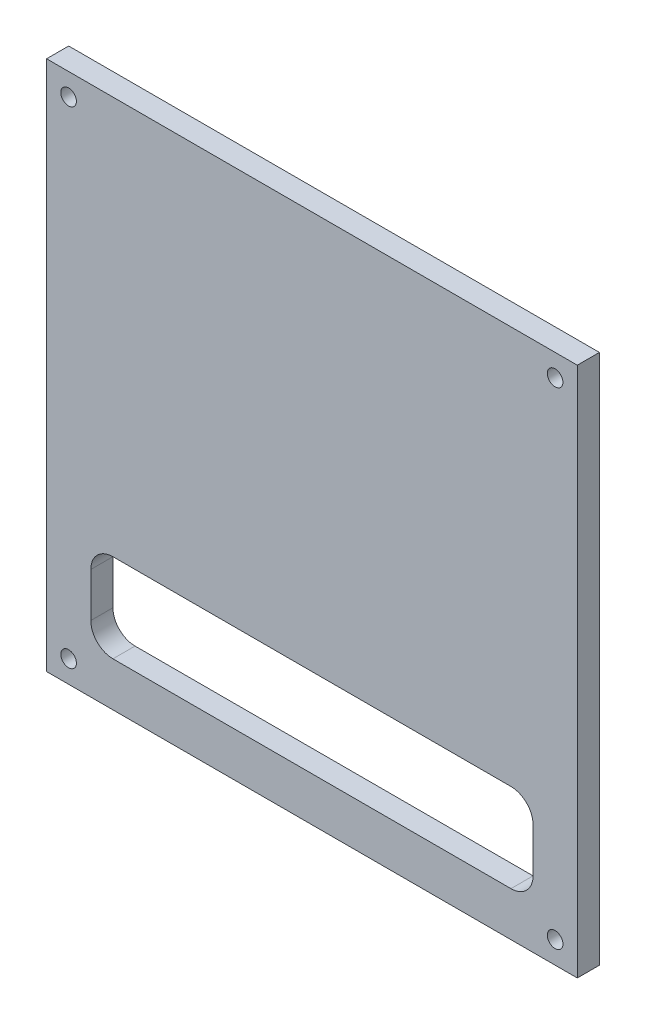
ISO-10303-21;
HEADER;
FILE_DESCRIPTION(('STEP AP214'),'2;1');
FILE_NAME('part.step','',(''),(''),'','','');
FILE_SCHEMA(('AUTOMOTIVE_DESIGN { 1 0 10303 214 1 1 1 1 }'));
ENDSEC;
DATA;
#1=APPLICATION_CONTEXT('core data for automotive mechanical design processes');
#2=APPLICATION_PROTOCOL_DEFINITION('international standard','automotive_design',2000,#1);
#3=PRODUCT_CONTEXT('',#1,'mechanical');
#4=PRODUCT('Part','Part','',(#3));
#5=PRODUCT_RELATED_PRODUCT_CATEGORY('part','',(#4));
#6=PRODUCT_DEFINITION_FORMATION('','',#4);
#7=PRODUCT_DEFINITION_CONTEXT('part definition',#1,'design');
#8=PRODUCT_DEFINITION('design','',#6,#7);
#9=PRODUCT_DEFINITION_SHAPE('','',#8);
#10=(LENGTH_UNIT() NAMED_UNIT(*) SI_UNIT(.MILLI.,.METRE.));
#11=(NAMED_UNIT(*) PLANE_ANGLE_UNIT() SI_UNIT($,.RADIAN.));
#12=(NAMED_UNIT(*) SI_UNIT($,.STERADIAN.) SOLID_ANGLE_UNIT());
#13=UNCERTAINTY_MEASURE_WITH_UNIT(LENGTH_MEASURE(1.E-05),#10,'distance_accuracy_value','');
#14=(GEOMETRIC_REPRESENTATION_CONTEXT(3) GLOBAL_UNCERTAINTY_ASSIGNED_CONTEXT((#13)) GLOBAL_UNIT_ASSIGNED_CONTEXT((#10,
#11,#12)) REPRESENTATION_CONTEXT('',''));
#15=CARTESIAN_POINT('',(0.,0.,0.));
#16=DIRECTION('',(0.,0.,1.));
#17=DIRECTION('',(1.,0.,0.));
#18=AXIS2_PLACEMENT_3D('',#15,#16,#17);
#19=CARTESIAN_POINT('',(-163.974683544304,2.38908752134528E-13,6.35));
#20=DIRECTION('',(1.,0.,0.));
#21=DIRECTION('',(0.,1.,0.));
#22=AXIS2_PLACEMENT_3D('',#19,#20,#21);
#23=PLANE('',#22);
#24=DIRECTION('',(0.,-1.,0.));
#25=VECTOR('',#24,1.);
#26=CARTESIAN_POINT('',(-163.974683544304,2.38908752134528E-13,0.));
#27=LINE('',#26,#25);
#28=CARTESIAN_POINT('',(-163.974683544304,235.851475625838,0.));
#29=VERTEX_POINT('',#28);
#30=CARTESIAN_POINT('',(-163.974683544304,83.4514756258377,0.));
#31=VERTEX_POINT('',#30);
#32=EDGE_CURVE('E181',#29,#31,#27,.T.);
#33=ORIENTED_EDGE('',*,*,#32,.F.);
#34=DIRECTION('',(0.,0.,-1.));
#35=VECTOR('',#34,1.);
#36=CARTESIAN_POINT('',(-163.974683544304,235.851475625838,6.35));
#37=LINE('',#36,#35);
#38=CARTESIAN_POINT('',(-163.974683544304,235.851475625838,6.35));
#39=VERTEX_POINT('',#38);
#40=EDGE_CURVE('E11',#39,#29,#37,.T.);
#41=ORIENTED_EDGE('',*,*,#40,.F.);
#42=DIRECTION('',(0.,-1.,0.));
#43=VECTOR('',#42,1.);
#44=CARTESIAN_POINT('',(-163.974683544304,2.38908752134528E-13,6.35));
#45=LINE('',#44,#43);
#46=CARTESIAN_POINT('',(-163.974683544304,83.4514756258377,6.35));
#47=VERTEX_POINT('',#46);
#48=EDGE_CURVE('E151',#39,#47,#45,.T.);
#49=ORIENTED_EDGE('',*,*,#48,.T.);
#50=DIRECTION('',(0.,0.,-1.));
#51=VECTOR('',#50,1.);
#52=CARTESIAN_POINT('',(-163.974683544304,83.4514756258377,6.35));
#53=LINE('',#52,#51);
#54=EDGE_CURVE('E101',#47,#31,#53,.T.);
#55=ORIENTED_EDGE('',*,*,#54,.T.);
#56=EDGE_LOOP('',(#33,#41,#49,#55));
#57=FACE_BOUND('',#56,.T.);
#58=ADVANCED_FACE('F35',(#57),#23,.T.);
#59=CARTESIAN_POINT('',(0.,235.851475625838,6.35));
#60=DIRECTION('',(0.,1.,0.));
#61=DIRECTION('',(0.,0.,1.));
#62=AXIS2_PLACEMENT_3D('',#59,#60,#61);
#63=PLANE('',#62);
#64=DIRECTION('',(1.,0.,0.));
#65=VECTOR('',#64,1.);
#66=CARTESIAN_POINT('',(0.,235.851475625838,0.));
#67=LINE('',#66,#65);
#68=CARTESIAN_POINT('',(-316.374683544304,235.851475625838,0.));
#69=VERTEX_POINT('',#68);
#70=EDGE_CURVE('E141',#69,#29,#67,.T.);
#71=ORIENTED_EDGE('',*,*,#70,.F.);
#72=DIRECTION('',(0.,0.,-1.));
#73=VECTOR('',#72,1.);
#74=CARTESIAN_POINT('',(-316.374683544304,235.851475625838,6.35));
#75=LINE('',#74,#73);
#76=CARTESIAN_POINT('',(-316.374683544304,235.851475625838,6.35));
#77=VERTEX_POINT('',#76);
#78=EDGE_CURVE('E45',#77,#69,#75,.T.);
#79=ORIENTED_EDGE('',*,*,#78,.F.);
#80=DIRECTION('',(1.,0.,0.));
#81=VECTOR('',#80,1.);
#82=CARTESIAN_POINT('',(0.,235.851475625838,6.35));
#83=LINE('',#82,#81);
#84=EDGE_CURVE('E139',#77,#39,#83,.T.);
#85=ORIENTED_EDGE('',*,*,#84,.T.);
#86=ORIENTED_EDGE('',*,*,#40,.T.);
#87=EDGE_LOOP('',(#71,#79,#85,#86));
#88=FACE_BOUND('',#87,.T.);
#89=ADVANCED_FACE('F137',(#88),#63,.T.);
#90=CARTESIAN_POINT('',(-316.374683544304,0.,6.35));
#91=DIRECTION('',(1.,0.,0.));
#92=DIRECTION('',(0.,0.,-1.));
#93=AXIS2_PLACEMENT_3D('',#90,#91,#92);
#94=PLANE('',#93);
#95=DIRECTION('',(0.,-1.,0.));
#96=VECTOR('',#95,1.);
#97=CARTESIAN_POINT('',(-316.374683544304,0.,0.));
#98=LINE('',#97,#96);
#99=CARTESIAN_POINT('',(-316.374683544304,83.4514756258377,0.));
#100=VERTEX_POINT('',#99);
#101=EDGE_CURVE('E184',#69,#100,#98,.T.);
#102=ORIENTED_EDGE('',*,*,#101,.T.);
#103=DIRECTION('',(0.,0.,-1.));
#104=VECTOR('',#103,1.);
#105=CARTESIAN_POINT('',(-316.374683544304,83.4514756258377,6.35));
#106=LINE('',#105,#104);
#107=CARTESIAN_POINT('',(-316.374683544304,83.4514756258377,6.35));
#108=VERTEX_POINT('',#107);
#109=EDGE_CURVE('E144',#108,#100,#106,.T.);
#110=ORIENTED_EDGE('',*,*,#109,.F.);
#111=DIRECTION('',(0.,-1.,0.));
#112=VECTOR('',#111,1.);
#113=CARTESIAN_POINT('',(-316.374683544304,0.,6.35));
#114=LINE('',#113,#112);
#115=EDGE_CURVE('E147',#77,#108,#114,.T.);
#116=ORIENTED_EDGE('',*,*,#115,.F.);
#117=ORIENTED_EDGE('',*,*,#78,.T.);
#118=EDGE_LOOP('',(#102,#110,#116,#117));
#119=FACE_BOUND('',#118,.T.);
#120=ADVANCED_FACE('F148',(#119),#94,.F.);
#121=CARTESIAN_POINT('',(-176.674683544304,0.,6.35));
#122=DIRECTION('',(-1.,0.,0.));
#123=DIRECTION('',(0.,0.,1.));
#124=AXIS2_PLACEMENT_3D('',#121,#122,#123);
#125=PLANE('',#124);
#126=DIRECTION('',(0.,1.,0.));
#127=VECTOR('',#126,1.);
#128=CARTESIAN_POINT('',(-176.674683544304,0.,0.));
#129=LINE('',#128,#127);
#130=CARTESIAN_POINT('',(-176.674683544304,102.501475625838,0.));
#131=VERTEX_POINT('',#130);
#132=CARTESIAN_POINT('',(-176.674683544304,115.201475625838,0.));
#133=VERTEX_POINT('',#132);
#134=EDGE_CURVE('E159',#131,#133,#129,.T.);
#135=ORIENTED_EDGE('',*,*,#134,.F.);
#136=DIRECTION('',(0.,0.,-1.));
#137=VECTOR('',#136,1.);
#138=CARTESIAN_POINT('',(-176.674683544304,102.501475625838,6.35));
#139=LINE('',#138,#137);
#140=CARTESIAN_POINT('',(-176.674683544304,102.501475625838,6.35));
#141=VERTEX_POINT('',#140);
#142=EDGE_CURVE('E39',#141,#131,#139,.T.);
#143=ORIENTED_EDGE('',*,*,#142,.F.);
#144=DIRECTION('',(0.,1.,0.));
#145=VECTOR('',#144,1.);
#146=CARTESIAN_POINT('',(-176.674683544304,0.,6.35));
#147=LINE('',#146,#145);
#148=CARTESIAN_POINT('',(-176.674683544304,115.201475625838,6.35));
#149=VERTEX_POINT('',#148);
#150=EDGE_CURVE('E187',#141,#149,#147,.T.);
#151=ORIENTED_EDGE('',*,*,#150,.T.);
#152=DIRECTION('',(0.,0.,-1.));
#153=VECTOR('',#152,1.);
#154=CARTESIAN_POINT('',(-176.674683544304,115.201475625838,6.35));
#155=LINE('',#154,#153);
#156=EDGE_CURVE('E158',#149,#133,#155,.T.);
#157=ORIENTED_EDGE('',*,*,#156,.T.);
#158=EDGE_LOOP('',(#135,#143,#151,#157));
#159=FACE_BOUND('',#158,.T.);
#160=ADVANCED_FACE('F37',(#159),#125,.T.);
#161=CARTESIAN_POINT('',(-183.024683544304,102.501475625838,6.35));
#162=DIRECTION('',(0.,0.,-1.));
#163=DIRECTION('',(-1.,0.,0.));
#164=AXIS2_PLACEMENT_3D('',#161,#162,#163);
#165=CYLINDRICAL_SURFACE('',#164,6.34999999999998);
#166=CARTESIAN_POINT('',(-183.024683544304,102.501475625838,0.));
#167=DIRECTION('',(0.,0.,1.));
#168=DIRECTION('',(1.,0.,0.));
#169=AXIS2_PLACEMENT_3D('',#166,#167,#168);
#170=CIRCLE('',#169,6.34999999999998);
#171=CARTESIAN_POINT('',(-183.024683544304,96.1514756258377,0.));
#172=VERTEX_POINT('',#171);
#173=EDGE_CURVE('E162',#172,#131,#170,.T.);
#174=ORIENTED_EDGE('',*,*,#173,.F.);
#175=DIRECTION('',(0.,0.,-1.));
#176=VECTOR('',#175,1.);
#177=CARTESIAN_POINT('',(-183.024683544304,96.1514756258377,6.35));
#178=LINE('',#177,#176);
#179=CARTESIAN_POINT('',(-183.024683544304,96.1514756258377,6.35));
#180=VERTEX_POINT('',#179);
#181=EDGE_CURVE('E203',#180,#172,#178,.T.);
#182=ORIENTED_EDGE('',*,*,#181,.F.);
#183=CARTESIAN_POINT('',(-183.024683544304,102.501475625838,6.35));
#184=DIRECTION('',(0.,0.,1.));
#185=DIRECTION('',(1.,0.,0.));
#186=AXIS2_PLACEMENT_3D('',#183,#184,#185);
#187=CIRCLE('',#186,6.34999999999998);
#188=EDGE_CURVE('E212',#180,#141,#187,.T.);
#189=ORIENTED_EDGE('',*,*,#188,.T.);
#190=ORIENTED_EDGE('',*,*,#142,.T.);
#191=EDGE_LOOP('',(#174,#182,#189,#190));
#192=FACE_BOUND('',#191,.T.);
#193=ADVANCED_FACE('F210',(#192),#165,.F.);
#194=CARTESIAN_POINT('',(0.,96.1514756258376,6.35));
#195=DIRECTION('',(0.,1.,0.));
#196=DIRECTION('',(-1.,0.,0.));
#197=AXIS2_PLACEMENT_3D('',#194,#195,#196);
#198=PLANE('',#197);
#199=DIRECTION('',(1.,0.,0.));
#200=VECTOR('',#199,1.);
#201=CARTESIAN_POINT('',(0.,96.1514756258376,0.));
#202=LINE('',#201,#200);
#203=CARTESIAN_POINT('',(-297.324683544304,96.1514756258377,0.));
#204=VERTEX_POINT('',#203);
#205=EDGE_CURVE('E166',#204,#172,#202,.T.);
#206=ORIENTED_EDGE('',*,*,#205,.F.);
#207=DIRECTION('',(0.,0.,-1.));
#208=VECTOR('',#207,1.);
#209=CARTESIAN_POINT('',(-297.324683544304,96.1514756258377,6.35));
#210=LINE('',#209,#208);
#211=CARTESIAN_POINT('',(-297.324683544304,96.1514756258377,6.35));
#212=VERTEX_POINT('',#211);
#213=EDGE_CURVE('E202',#212,#204,#210,.T.);
#214=ORIENTED_EDGE('',*,*,#213,.F.);
#215=DIRECTION('',(1.,0.,0.));
#216=VECTOR('',#215,1.);
#217=CARTESIAN_POINT('',(0.,96.1514756258376,6.35));
#218=LINE('',#217,#216);
#219=EDGE_CURVE('E221',#212,#180,#218,.T.);
#220=ORIENTED_EDGE('',*,*,#219,.T.);
#221=ORIENTED_EDGE('',*,*,#181,.T.);
#222=EDGE_LOOP('',(#206,#214,#220,#221));
#223=FACE_BOUND('',#222,.T.);
#224=ADVANCED_FACE('F219',(#223),#198,.T.);
#225=CARTESIAN_POINT('',(-297.324683544304,102.501475625838,6.35));
#226=DIRECTION('',(0.,0.,-1.));
#227=DIRECTION('',(-1.,0.,0.));
#228=AXIS2_PLACEMENT_3D('',#225,#226,#227);
#229=CYLINDRICAL_SURFACE('',#228,6.34999999999998);
#230=CARTESIAN_POINT('',(-297.324683544304,102.501475625838,0.));
#231=DIRECTION('',(0.,0.,1.));
#232=DIRECTION('',(1.,0.,0.));
#233=AXIS2_PLACEMENT_3D('',#230,#231,#232);
#234=CIRCLE('',#233,6.34999999999998);
#235=CARTESIAN_POINT('',(-303.674683544304,102.501475625838,0.));
#236=VERTEX_POINT('',#235);
#237=EDGE_CURVE('E169',#236,#204,#234,.T.);
#238=ORIENTED_EDGE('',*,*,#237,.F.);
#239=DIRECTION('',(0.,0.,-1.));
#240=VECTOR('',#239,1.);
#241=CARTESIAN_POINT('',(-303.674683544304,102.501475625838,6.35));
#242=LINE('',#241,#240);
#243=CARTESIAN_POINT('',(-303.674683544304,102.501475625838,6.35));
#244=VERTEX_POINT('',#243);
#245=EDGE_CURVE('E200',#244,#236,#242,.T.);
#246=ORIENTED_EDGE('',*,*,#245,.F.);
#247=CARTESIAN_POINT('',(-297.324683544304,102.501475625838,6.35));
#248=DIRECTION('',(0.,0.,1.));
#249=DIRECTION('',(1.,0.,0.));
#250=AXIS2_PLACEMENT_3D('',#247,#248,#249);
#251=CIRCLE('',#250,6.34999999999998);
#252=EDGE_CURVE('E226',#244,#212,#251,.T.);
#253=ORIENTED_EDGE('',*,*,#252,.T.);
#254=ORIENTED_EDGE('',*,*,#213,.T.);
#255=EDGE_LOOP('',(#238,#246,#253,#254));
#256=FACE_BOUND('',#255,.T.);
#257=ADVANCED_FACE('F228',(#256),#229,.F.);
#258=CARTESIAN_POINT('',(-303.674683544304,0.,6.35));
#259=DIRECTION('',(-1.,0.,0.));
#260=DIRECTION('',(0.,0.,1.));
#261=AXIS2_PLACEMENT_3D('',#258,#259,#260);
#262=PLANE('',#261);
#263=DIRECTION('',(0.,1.,0.));
#264=VECTOR('',#263,1.);
#265=CARTESIAN_POINT('',(-303.674683544304,0.,0.));
#266=LINE('',#265,#264);
#267=CARTESIAN_POINT('',(-303.674683544304,115.201475625838,0.));
#268=VERTEX_POINT('',#267);
#269=EDGE_CURVE('E172',#236,#268,#266,.T.);
#270=ORIENTED_EDGE('',*,*,#269,.T.);
#271=DIRECTION('',(0.,0.,-1.));
#272=VECTOR('',#271,1.);
#273=CARTESIAN_POINT('',(-303.674683544304,115.201475625838,6.35));
#274=LINE('',#273,#272);
#275=CARTESIAN_POINT('',(-303.674683544304,115.201475625838,6.35));
#276=VERTEX_POINT('',#275);
#277=EDGE_CURVE('E197',#276,#268,#274,.T.);
#278=ORIENTED_EDGE('',*,*,#277,.F.);
#279=DIRECTION('',(0.,1.,0.));
#280=VECTOR('',#279,1.);
#281=CARTESIAN_POINT('',(-303.674683544304,0.,6.35));
#282=LINE('',#281,#280);
#283=EDGE_CURVE('E230',#244,#276,#282,.T.);
#284=ORIENTED_EDGE('',*,*,#283,.F.);
#285=ORIENTED_EDGE('',*,*,#245,.T.);
#286=EDGE_LOOP('',(#270,#278,#284,#285));
#287=FACE_BOUND('',#286,.T.);
#288=ADVANCED_FACE('F313',(#287),#262,.F.);
#289=CARTESIAN_POINT('',(-297.324683544304,115.201475625838,6.35));
#290=DIRECTION('',(0.,0.,-1.));
#291=DIRECTION('',(-1.,0.,0.));
#292=AXIS2_PLACEMENT_3D('',#289,#290,#291);
#293=CYLINDRICAL_SURFACE('',#292,6.34999999999997);
#294=CARTESIAN_POINT('',(-297.324683544304,115.201475625838,0.));
#295=DIRECTION('',(0.,0.,1.));
#296=DIRECTION('',(1.,0.,0.));
#297=AXIS2_PLACEMENT_3D('',#294,#295,#296);
#298=CIRCLE('',#297,6.34999999999997);
#299=CARTESIAN_POINT('',(-297.324683544304,121.551475625838,0.));
#300=VERTEX_POINT('',#299);
#301=EDGE_CURVE('E174',#268,#300,#298,.F.);
#302=ORIENTED_EDGE('',*,*,#301,.T.);
#303=DIRECTION('',(0.,0.,-1.));
#304=VECTOR('',#303,1.);
#305=CARTESIAN_POINT('',(-297.324683544304,121.551475625838,6.35));
#306=LINE('',#305,#304);
#307=CARTESIAN_POINT('',(-297.324683544304,121.551475625838,6.35));
#308=VERTEX_POINT('',#307);
#309=EDGE_CURVE('E194',#308,#300,#306,.T.);
#310=ORIENTED_EDGE('',*,*,#309,.F.);
#311=CARTESIAN_POINT('',(-297.324683544304,115.201475625838,6.35));
#312=DIRECTION('',(0.,0.,1.));
#313=DIRECTION('',(1.,0.,0.));
#314=AXIS2_PLACEMENT_3D('',#311,#312,#313);
#315=CIRCLE('',#314,6.34999999999997);
#316=EDGE_CURVE('E232',#276,#308,#315,.F.);
#317=ORIENTED_EDGE('',*,*,#316,.F.);
#318=ORIENTED_EDGE('',*,*,#277,.T.);
#319=EDGE_LOOP('',(#302,#310,#317,#318));
#320=FACE_BOUND('',#319,.T.);
#321=ADVANCED_FACE('F309',(#320),#293,.F.);
#322=CARTESIAN_POINT('',(0.,121.551475625838,6.35));
#323=DIRECTION('',(0.,1.,0.));
#324=DIRECTION('',(0.,0.,1.));
#325=AXIS2_PLACEMENT_3D('',#322,#323,#324);
#326=PLANE('',#325);
#327=DIRECTION('',(1.,0.,0.));
#328=VECTOR('',#327,1.);
#329=CARTESIAN_POINT('',(0.,121.551475625838,0.));
#330=LINE('',#329,#328);
#331=CARTESIAN_POINT('',(-183.024683544304,121.551475625838,0.));
#332=VERTEX_POINT('',#331);
#333=EDGE_CURVE('E176',#300,#332,#330,.T.);
#334=ORIENTED_EDGE('',*,*,#333,.T.);
#335=DIRECTION('',(0.,0.,-1.));
#336=VECTOR('',#335,1.);
#337=CARTESIAN_POINT('',(-183.024683544304,121.551475625838,6.35));
#338=LINE('',#337,#336);
#339=CARTESIAN_POINT('',(-183.024683544304,121.551475625838,6.35));
#340=VERTEX_POINT('',#339);
#341=EDGE_CURVE('E191',#340,#332,#338,.T.);
#342=ORIENTED_EDGE('',*,*,#341,.F.);
#343=DIRECTION('',(1.,0.,0.));
#344=VECTOR('',#343,1.);
#345=CARTESIAN_POINT('',(0.,121.551475625838,6.35));
#346=LINE('',#345,#344);
#347=EDGE_CURVE('E237',#308,#340,#346,.T.);
#348=ORIENTED_EDGE('',*,*,#347,.F.);
#349=ORIENTED_EDGE('',*,*,#309,.T.);
#350=EDGE_LOOP('',(#334,#342,#348,#349));
#351=FACE_BOUND('',#350,.T.);
#352=ADVANCED_FACE('F306',(#351),#326,.F.);
#353=CARTESIAN_POINT('',(-183.024683544304,115.201475625838,6.35));
#354=DIRECTION('',(0.,0.,-1.));
#355=DIRECTION('',(-1.,0.,0.));
#356=AXIS2_PLACEMENT_3D('',#353,#354,#355);
#357=CYLINDRICAL_SURFACE('',#356,6.34999999999997);
#358=CARTESIAN_POINT('',(-183.024683544304,115.201475625838,0.));
#359=DIRECTION('',(0.,0.,1.));
#360=DIRECTION('',(1.,0.,0.));
#361=AXIS2_PLACEMENT_3D('',#358,#359,#360);
#362=CIRCLE('',#361,6.34999999999997);
#363=EDGE_CURVE('E178',#332,#133,#362,.F.);
#364=ORIENTED_EDGE('',*,*,#363,.T.);
#365=ORIENTED_EDGE('',*,*,#156,.F.);
#366=CARTESIAN_POINT('',(-183.024683544304,115.201475625838,6.35));
#367=DIRECTION('',(0.,0.,1.));
#368=DIRECTION('',(1.,0.,0.));
#369=AXIS2_PLACEMENT_3D('',#366,#367,#368);
#370=CIRCLE('',#369,6.34999999999997);
#371=EDGE_CURVE('E153',#340,#149,#370,.F.);
#372=ORIENTED_EDGE('',*,*,#371,.F.);
#373=ORIENTED_EDGE('',*,*,#341,.T.);
#374=EDGE_LOOP('',(#364,#365,#372,#373));
#375=FACE_BOUND('',#374,.T.);
#376=ADVANCED_FACE('F242',(#375),#357,.F.);
#377=CARTESIAN_POINT('',(0.,83.4514756258377,6.35));
#378=DIRECTION('',(0.,1.,0.));
#379=DIRECTION('',(0.,0.,1.));
#380=AXIS2_PLACEMENT_3D('',#377,#378,#379);
#381=PLANE('',#380);
#382=DIRECTION('',(1.,0.,0.));
#383=VECTOR('',#382,1.);
#384=CARTESIAN_POINT('',(0.,83.4514756258377,0.));
#385=LINE('',#384,#383);
#386=EDGE_CURVE('E94',#100,#31,#385,.T.);
#387=ORIENTED_EDGE('',*,*,#386,.T.);
#388=ORIENTED_EDGE('',*,*,#54,.F.);
#389=DIRECTION('',(1.,0.,0.));
#390=VECTOR('',#389,1.);
#391=CARTESIAN_POINT('',(0.,83.4514756258377,6.35));
#392=LINE('',#391,#390);
#393=EDGE_CURVE('E54',#108,#47,#392,.T.);
#394=ORIENTED_EDGE('',*,*,#393,.F.);
#395=ORIENTED_EDGE('',*,*,#109,.T.);
#396=EDGE_LOOP('',(#387,#388,#394,#395));
#397=FACE_BOUND('',#396,.T.);
#398=ADVANCED_FACE('F273',(#397),#381,.F.);
#399=CARTESIAN_POINT('',(0.,0.,6.35));
#400=DIRECTION('',(0.,0.,1.));
#401=DIRECTION('',(1.,0.,0.));
#402=AXIS2_PLACEMENT_3D('',#399,#400,#401);
#403=PLANE('',#402);
#404=CARTESIAN_POINT('',(-170.351516203958,89.8179385362006,6.35));
#405=DIRECTION('',(0.,0.,1.));
#406=DIRECTION('',(1.,0.,0.));
#407=AXIS2_PLACEMENT_3D('',#404,#405,#406);
#408=CIRCLE('',#407,2.2479);
#409=CARTESIAN_POINT('',(-168.103616203958,89.8179385362006,6.35));
#410=VERTEX_POINT('',#409);
#411=EDGE_CURVE('E265',#410,#410,#408,.T.);
#412=ORIENTED_EDGE('',*,*,#411,.F.);
#413=EDGE_LOOP('',(#412));
#414=FACE_BOUND('',#413,.T.);
#415=CARTESIAN_POINT('',(-310.051516203958,89.8179385362006,6.35));
#416=DIRECTION('',(0.,0.,1.));
#417=DIRECTION('',(1.,0.,0.));
#418=AXIS2_PLACEMENT_3D('',#415,#416,#417);
#419=CIRCLE('',#418,2.24789999999997);
#420=CARTESIAN_POINT('',(-307.803616203958,89.8179385362006,6.35));
#421=VERTEX_POINT('',#420);
#422=EDGE_CURVE('E259',#421,#421,#419,.T.);
#423=ORIENTED_EDGE('',*,*,#422,.F.);
#424=EDGE_LOOP('',(#423));
#425=FACE_BOUND('',#424,.T.);
#426=CARTESIAN_POINT('',(-170.351516203958,229.517938536201,6.35));
#427=DIRECTION('',(0.,0.,1.));
#428=DIRECTION('',(1.,0.,0.));
#429=AXIS2_PLACEMENT_3D('',#426,#427,#428);
#430=CIRCLE('',#429,2.2479);
#431=CARTESIAN_POINT('',(-168.103616203958,229.517938536201,6.35));
#432=VERTEX_POINT('',#431);
#433=EDGE_CURVE('E253',#432,#432,#430,.T.);
#434=ORIENTED_EDGE('',*,*,#433,.F.);
#435=EDGE_LOOP('',(#434));
#436=FACE_BOUND('',#435,.T.);
#437=CARTESIAN_POINT('',(-310.051516203958,229.517938536201,6.35));
#438=DIRECTION('',(0.,0.,1.));
#439=DIRECTION('',(1.,0.,0.));
#440=AXIS2_PLACEMENT_3D('',#437,#438,#439);
#441=CIRCLE('',#440,2.24789999999997);
#442=CARTESIAN_POINT('',(-307.803616203958,229.517938536201,6.35));
#443=VERTEX_POINT('',#442);
#444=EDGE_CURVE('E247',#443,#443,#441,.T.);
#445=ORIENTED_EDGE('',*,*,#444,.F.);
#446=EDGE_LOOP('',(#445));
#447=FACE_BOUND('',#446,.T.);
#448=ORIENTED_EDGE('',*,*,#150,.F.);
#449=ORIENTED_EDGE('',*,*,#188,.F.);
#450=ORIENTED_EDGE('',*,*,#219,.F.);
#451=ORIENTED_EDGE('',*,*,#252,.F.);
#452=ORIENTED_EDGE('',*,*,#283,.T.);
#453=ORIENTED_EDGE('',*,*,#316,.T.);
#454=ORIENTED_EDGE('',*,*,#347,.T.);
#455=ORIENTED_EDGE('',*,*,#371,.T.);
#456=EDGE_LOOP('',(#448,#449,#450,#451,#452,#453,#454,#455));
#457=FACE_BOUND('',#456,.T.);
#458=ORIENTED_EDGE('',*,*,#48,.F.);
#459=ORIENTED_EDGE('',*,*,#84,.F.);
#460=ORIENTED_EDGE('',*,*,#115,.T.);
#461=ORIENTED_EDGE('',*,*,#393,.T.);
#462=EDGE_LOOP('',(#458,#459,#460,#461));
#463=FACE_BOUND('',#462,.T.);
#464=ADVANCED_FACE('F150',(#414,#425,#436,#447,#457,#463),#403,.T.);
#465=CARTESIAN_POINT('',(0.,0.,0.));
#466=DIRECTION('',(0.,0.,1.));
#467=DIRECTION('',(1.,0.,0.));
#468=AXIS2_PLACEMENT_3D('',#465,#466,#467);
#469=PLANE('',#468);
#470=CARTESIAN_POINT('',(-170.351516203958,89.8179385362006,0.));
#471=DIRECTION('',(0.,0.,1.));
#472=DIRECTION('',(1.,0.,0.));
#473=AXIS2_PLACEMENT_3D('',#470,#471,#472);
#474=CIRCLE('',#473,2.2479);
#475=CARTESIAN_POINT('',(-168.103616203958,89.8179385362006,0.));
#476=VERTEX_POINT('',#475);
#477=EDGE_CURVE('E262',#476,#476,#474,.T.);
#478=ORIENTED_EDGE('',*,*,#477,.T.);
#479=EDGE_LOOP('',(#478));
#480=FACE_BOUND('',#479,.T.);
#481=CARTESIAN_POINT('',(-310.051516203958,89.8179385362006,0.));
#482=DIRECTION('',(0.,0.,1.));
#483=DIRECTION('',(1.,0.,0.));
#484=AXIS2_PLACEMENT_3D('',#481,#482,#483);
#485=CIRCLE('',#484,2.24789999999997);
#486=CARTESIAN_POINT('',(-307.803616203958,89.8179385362006,0.));
#487=VERTEX_POINT('',#486);
#488=EDGE_CURVE('E256',#487,#487,#485,.T.);
#489=ORIENTED_EDGE('',*,*,#488,.T.);
#490=EDGE_LOOP('',(#489));
#491=FACE_BOUND('',#490,.T.);
#492=CARTESIAN_POINT('',(-170.351516203958,229.517938536201,0.));
#493=DIRECTION('',(0.,0.,1.));
#494=DIRECTION('',(1.,0.,0.));
#495=AXIS2_PLACEMENT_3D('',#492,#493,#494);
#496=CIRCLE('',#495,2.2479);
#497=CARTESIAN_POINT('',(-168.103616203958,229.517938536201,0.));
#498=VERTEX_POINT('',#497);
#499=EDGE_CURVE('E250',#498,#498,#496,.T.);
#500=ORIENTED_EDGE('',*,*,#499,.T.);
#501=EDGE_LOOP('',(#500));
#502=FACE_BOUND('',#501,.T.);
#503=CARTESIAN_POINT('',(-310.051516203958,229.517938536201,0.));
#504=DIRECTION('',(0.,0.,1.));
#505=DIRECTION('',(1.,0.,0.));
#506=AXIS2_PLACEMENT_3D('',#503,#504,#505);
#507=CIRCLE('',#506,2.24789999999997);
#508=CARTESIAN_POINT('',(-307.803616203958,229.517938536201,0.));
#509=VERTEX_POINT('',#508);
#510=EDGE_CURVE('E163',#509,#509,#507,.T.);
#511=ORIENTED_EDGE('',*,*,#510,.T.);
#512=EDGE_LOOP('',(#511));
#513=FACE_BOUND('',#512,.T.);
#514=ORIENTED_EDGE('',*,*,#134,.T.);
#515=ORIENTED_EDGE('',*,*,#363,.F.);
#516=ORIENTED_EDGE('',*,*,#333,.F.);
#517=ORIENTED_EDGE('',*,*,#301,.F.);
#518=ORIENTED_EDGE('',*,*,#269,.F.);
#519=ORIENTED_EDGE('',*,*,#237,.T.);
#520=ORIENTED_EDGE('',*,*,#205,.T.);
#521=ORIENTED_EDGE('',*,*,#173,.T.);
#522=EDGE_LOOP('',(#514,#515,#516,#517,#518,#519,#520,#521));
#523=FACE_BOUND('',#522,.T.);
#524=ORIENTED_EDGE('',*,*,#32,.T.);
#525=ORIENTED_EDGE('',*,*,#386,.F.);
#526=ORIENTED_EDGE('',*,*,#101,.F.);
#527=ORIENTED_EDGE('',*,*,#70,.T.);
#528=EDGE_LOOP('',(#524,#525,#526,#527));
#529=FACE_BOUND('',#528,.T.);
#530=ADVANCED_FACE('F216',(#480,#491,#502,#513,#523,#529),#469,.F.);
#531=CARTESIAN_POINT('',(-310.051516203958,229.517938536201,6.35));
#532=DIRECTION('',(0.,0.,1.));
#533=DIRECTION('',(1.,0.,0.));
#534=AXIS2_PLACEMENT_3D('',#531,#532,#533);
#535=CYLINDRICAL_SURFACE('',#534,2.24789999999997);
#536=ORIENTED_EDGE('',*,*,#510,.F.);
#537=EDGE_LOOP('',(#536));
#538=FACE_BOUND('',#537,.T.);
#539=ORIENTED_EDGE('',*,*,#444,.T.);
#540=EDGE_LOOP('',(#539));
#541=FACE_BOUND('',#540,.T.);
#542=ADVANCED_FACE('F281',(#538,#541),#535,.F.);
#543=CARTESIAN_POINT('',(-170.351516203958,229.517938536201,6.35));
#544=DIRECTION('',(0.,0.,1.));
#545=DIRECTION('',(1.,0.,0.));
#546=AXIS2_PLACEMENT_3D('',#543,#544,#545);
#547=CYLINDRICAL_SURFACE('',#546,2.2479);
#548=ORIENTED_EDGE('',*,*,#499,.F.);
#549=EDGE_LOOP('',(#548));
#550=FACE_BOUND('',#549,.T.);
#551=ORIENTED_EDGE('',*,*,#433,.T.);
#552=EDGE_LOOP('',(#551));
#553=FACE_BOUND('',#552,.T.);
#554=ADVANCED_FACE('F283',(#550,#553),#547,.F.);
#555=CARTESIAN_POINT('',(-310.051516203958,89.8179385362006,6.35));
#556=DIRECTION('',(0.,0.,1.));
#557=DIRECTION('',(1.,0.,0.));
#558=AXIS2_PLACEMENT_3D('',#555,#556,#557);
#559=CYLINDRICAL_SURFACE('',#558,2.24789999999997);
#560=ORIENTED_EDGE('',*,*,#488,.F.);
#561=EDGE_LOOP('',(#560));
#562=FACE_BOUND('',#561,.T.);
#563=ORIENTED_EDGE('',*,*,#422,.T.);
#564=EDGE_LOOP('',(#563));
#565=FACE_BOUND('',#564,.T.);
#566=ADVANCED_FACE('F290',(#562,#565),#559,.F.);
#567=CARTESIAN_POINT('',(-170.351516203958,89.8179385362006,6.35));
#568=DIRECTION('',(0.,0.,1.));
#569=DIRECTION('',(1.,0.,0.));
#570=AXIS2_PLACEMENT_3D('',#567,#568,#569);
#571=CYLINDRICAL_SURFACE('',#570,2.2479);
#572=ORIENTED_EDGE('',*,*,#477,.F.);
#573=EDGE_LOOP('',(#572));
#574=FACE_BOUND('',#573,.T.);
#575=ORIENTED_EDGE('',*,*,#411,.T.);
#576=EDGE_LOOP('',(#575));
#577=FACE_BOUND('',#576,.T.);
#578=ADVANCED_FACE('F269',(#574,#577),#571,.F.);
#579=CLOSED_SHELL('',(#58,#89,#120,#160,#193,#224,#257,#288,#321,#352,#376,#398,#464,#530,#542,
#554,#566,#578));
#580=MANIFOLD_SOLID_BREP('B2',#579);
#581=ADVANCED_BREP_SHAPE_REPRESENTATION('',(#18,#580),#14);
#582=SHAPE_DEFINITION_REPRESENTATION(#9,#581);
ENDSEC;
END-ISO-10303-21;
